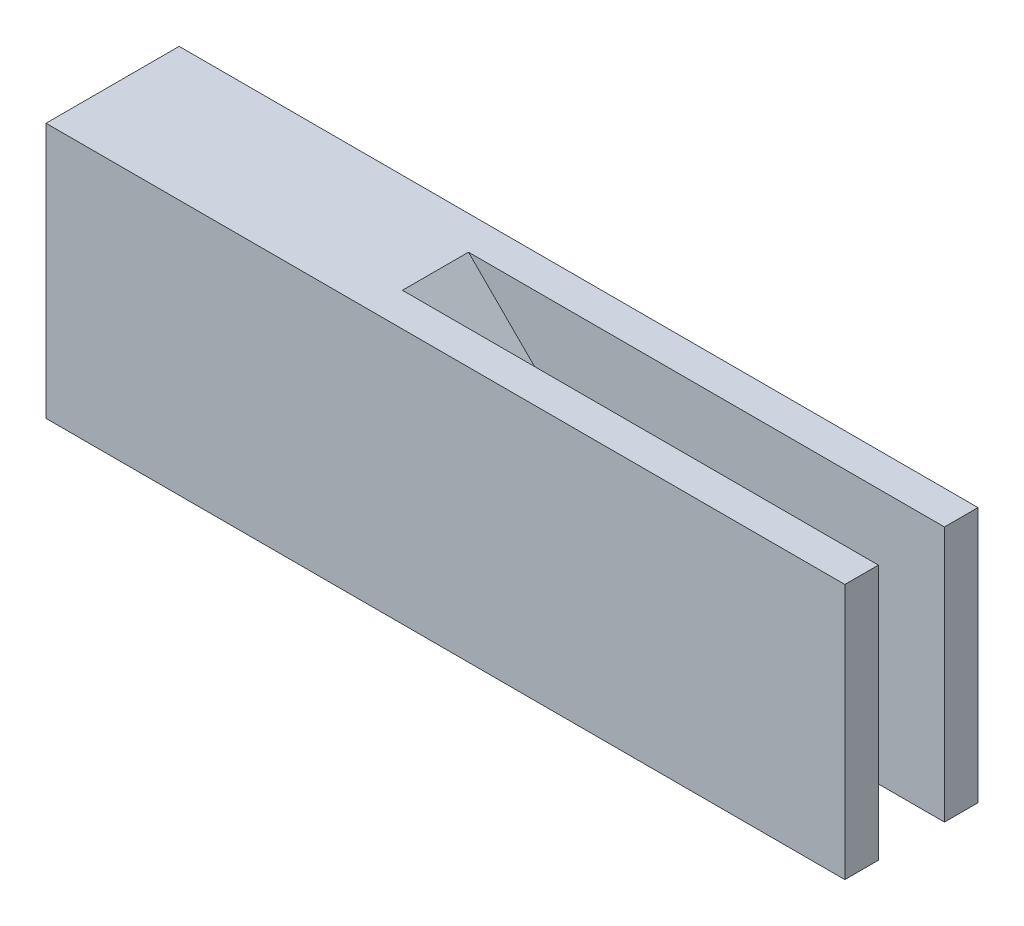
ISO-10303-21;
HEADER;
FILE_DESCRIPTION(('STEP AP214'),'2;1');
FILE_NAME('part.step','',(''),(''),'','','');
FILE_SCHEMA(('AUTOMOTIVE_DESIGN { 1 0 10303 214 1 1 1 1 }'));
ENDSEC;
DATA;
#1=APPLICATION_CONTEXT('core data for automotive mechanical design processes');
#2=APPLICATION_PROTOCOL_DEFINITION('international standard','automotive_design',2000,#1);
#3=PRODUCT_CONTEXT('',#1,'mechanical');
#4=PRODUCT('Part','Part','',(#3));
#5=PRODUCT_RELATED_PRODUCT_CATEGORY('part','',(#4));
#6=PRODUCT_DEFINITION_FORMATION('','',#4);
#7=PRODUCT_DEFINITION_CONTEXT('part definition',#1,'design');
#8=PRODUCT_DEFINITION('design','',#6,#7);
#9=PRODUCT_DEFINITION_SHAPE('','',#8);
#10=(LENGTH_UNIT() NAMED_UNIT(*) SI_UNIT(.MILLI.,.METRE.));
#11=(NAMED_UNIT(*) PLANE_ANGLE_UNIT() SI_UNIT($,.RADIAN.));
#12=(NAMED_UNIT(*) SI_UNIT($,.STERADIAN.) SOLID_ANGLE_UNIT());
#13=UNCERTAINTY_MEASURE_WITH_UNIT(LENGTH_MEASURE(1.E-05),#10,'distance_accuracy_value','');
#14=(GEOMETRIC_REPRESENTATION_CONTEXT(3) GLOBAL_UNCERTAINTY_ASSIGNED_CONTEXT((#13)) GLOBAL_UNIT_ASSIGNED_CONTEXT((#10,
#11,#12)) REPRESENTATION_CONTEXT('',''));
#15=CARTESIAN_POINT('',(0.,0.,0.));
#16=DIRECTION('',(0.,0.,1.));
#17=DIRECTION('',(1.,0.,0.));
#18=AXIS2_PLACEMENT_3D('',#15,#16,#17);
#19=CARTESIAN_POINT('',(25.4,0.,0.));
#20=DIRECTION('',(-1.,0.,0.));
#21=DIRECTION('',(0.,0.,1.));
#22=AXIS2_PLACEMENT_3D('',#19,#20,#21);
#23=PLANE('',#22);
#24=DIRECTION('',(0.,-1.,0.));
#25=VECTOR('',#24,1.);
#26=CARTESIAN_POINT('',(25.4,12.192,-4.7498));
#27=LINE('',#26,#25);
#28=CARTESIAN_POINT('',(25.4,2.19199999999999,-4.7498));
#29=VERTEX_POINT('',#28);
#30=CARTESIAN_POINT('',(25.4,0.,-4.7498));
#31=VERTEX_POINT('',#30);
#32=EDGE_CURVE('E139',#29,#31,#27,.T.);
#33=ORIENTED_EDGE('',*,*,#32,.F.);
#34=DIRECTION('',(0.,0.,1.));
#35=VECTOR('',#34,1.);
#36=CARTESIAN_POINT('',(25.4,2.19199999999999,0.));
#37=LINE('',#36,#35);
#38=CARTESIAN_POINT('',(25.4,2.19199999999999,-1.6002));
#39=VERTEX_POINT('',#38);
#40=EDGE_CURVE('E203',#29,#39,#37,.T.);
#41=ORIENTED_EDGE('',*,*,#40,.T.);
#42=DIRECTION('',(0.,1.,0.));
#43=VECTOR('',#42,1.);
#44=CARTESIAN_POINT('',(25.4,12.192,-1.6002));
#45=LINE('',#44,#43);
#46=CARTESIAN_POINT('',(25.4,0.,-1.6002));
#47=VERTEX_POINT('',#46);
#48=EDGE_CURVE('E154',#47,#39,#45,.T.);
#49=ORIENTED_EDGE('',*,*,#48,.F.);
#50=DIRECTION('',(0.,0.,-1.));
#51=VECTOR('',#50,1.);
#52=CARTESIAN_POINT('',(25.4,0.,0.));
#53=LINE('',#52,#51);
#54=EDGE_CURVE('E179',#47,#31,#53,.T.);
#55=ORIENTED_EDGE('',*,*,#54,.T.);
#56=EDGE_LOOP('',(#33,#41,#49,#55));
#57=FACE_BOUND('',#56,.T.);
#58=ADVANCED_FACE('F41',(#57),#23,.F.);
#59=CARTESIAN_POINT('',(25.4,0.,0.));
#60=DIRECTION('',(0.,0.,-1.));
#61=DIRECTION('',(0.,1.,0.));
#62=AXIS2_PLACEMENT_3D('',#59,#60,#61);
#63=PLANE('',#62);
#64=DIRECTION('',(0.,-1.,0.));
#65=VECTOR('',#64,1.);
#66=CARTESIAN_POINT('',(0.,0.,0.));
#67=LINE('',#66,#65);
#68=CARTESIAN_POINT('',(0.,12.192,0.));
#69=VERTEX_POINT('',#68);
#70=CARTESIAN_POINT('',(0.,0.,0.));
#71=VERTEX_POINT('',#70);
#72=EDGE_CURVE('E178',#69,#71,#67,.T.);
#73=ORIENTED_EDGE('',*,*,#72,.T.);
#74=DIRECTION('',(-1.,0.,0.));
#75=VECTOR('',#74,1.);
#76=CARTESIAN_POINT('',(25.4,0.,0.));
#77=LINE('',#76,#75);
#78=CARTESIAN_POINT('',(38.1,0.,0.));
#79=VERTEX_POINT('',#78);
#80=EDGE_CURVE('E199',#79,#71,#77,.T.);
#81=ORIENTED_EDGE('',*,*,#80,.F.);
#82=DIRECTION('',(0.,-1.,0.));
#83=VECTOR('',#82,1.);
#84=CARTESIAN_POINT('',(38.1,12.192,0.));
#85=LINE('',#84,#83);
#86=CARTESIAN_POINT('',(38.1,12.192,0.));
#87=VERTEX_POINT('',#86);
#88=EDGE_CURVE('E155',#87,#79,#85,.T.);
#89=ORIENTED_EDGE('',*,*,#88,.F.);
#90=DIRECTION('',(-1.,0.,0.));
#91=VECTOR('',#90,1.);
#92=CARTESIAN_POINT('',(25.4,12.192,0.));
#93=LINE('',#92,#91);
#94=EDGE_CURVE('E126',#87,#69,#93,.T.);
#95=ORIENTED_EDGE('',*,*,#94,.T.);
#96=EDGE_LOOP('',(#73,#81,#89,#95));
#97=FACE_BOUND('',#96,.T.);
#98=ADVANCED_FACE('F230',(#97),#63,.F.);
#99=CARTESIAN_POINT('',(25.4,0.,0.));
#100=DIRECTION('',(0.,1.,0.));
#101=DIRECTION('',(0.,0.,1.));
#102=AXIS2_PLACEMENT_3D('',#99,#100,#101);
#103=PLANE('',#102);
#104=DIRECTION('',(0.,0.,-1.));
#105=VECTOR('',#104,1.);
#106=CARTESIAN_POINT('',(0.,0.,0.));
#107=LINE('',#106,#105);
#108=CARTESIAN_POINT('',(0.,0.,-6.35));
#109=VERTEX_POINT('',#108);
#110=EDGE_CURVE('E187',#71,#109,#107,.T.);
#111=ORIENTED_EDGE('',*,*,#110,.T.);
#112=DIRECTION('',(-1.,0.,0.));
#113=VECTOR('',#112,1.);
#114=CARTESIAN_POINT('',(25.4,0.,-6.35));
#115=LINE('',#114,#113);
#116=CARTESIAN_POINT('',(38.1,0.,-6.35));
#117=VERTEX_POINT('',#116);
#118=EDGE_CURVE('E125',#117,#109,#115,.T.);
#119=ORIENTED_EDGE('',*,*,#118,.F.);
#120=DIRECTION('',(0.,0.,-1.));
#121=VECTOR('',#120,1.);
#122=CARTESIAN_POINT('',(38.1,0.,-6.35));
#123=LINE('',#122,#121);
#124=CARTESIAN_POINT('',(38.1,0.,-4.7498));
#125=VERTEX_POINT('',#124);
#126=EDGE_CURVE('E137',#125,#117,#123,.T.);
#127=ORIENTED_EDGE('',*,*,#126,.F.);
#128=DIRECTION('',(-1.,0.,0.));
#129=VECTOR('',#128,1.);
#130=CARTESIAN_POINT('',(38.1,0.,-4.7498));
#131=LINE('',#130,#129);
#132=EDGE_CURVE('E147',#125,#31,#131,.T.);
#133=ORIENTED_EDGE('',*,*,#132,.T.);
#134=ORIENTED_EDGE('',*,*,#54,.F.);
#135=DIRECTION('',(-1.,0.,0.));
#136=VECTOR('',#135,1.);
#137=CARTESIAN_POINT('',(38.1,0.,-1.6002));
#138=LINE('',#137,#136);
#139=CARTESIAN_POINT('',(38.1,0.,-1.6002));
#140=VERTEX_POINT('',#139);
#141=EDGE_CURVE('E174',#140,#47,#138,.T.);
#142=ORIENTED_EDGE('',*,*,#141,.F.);
#143=DIRECTION('',(0.,0.,-1.));
#144=VECTOR('',#143,1.);
#145=CARTESIAN_POINT('',(38.1,0.,0.));
#146=LINE('',#145,#144);
#147=EDGE_CURVE('E159',#79,#140,#146,.T.);
#148=ORIENTED_EDGE('',*,*,#147,.F.);
#149=ORIENTED_EDGE('',*,*,#80,.T.);
#150=EDGE_LOOP('',(#111,#119,#127,#133,#134,#142,#148,#149));
#151=FACE_BOUND('',#150,.T.);
#152=ADVANCED_FACE('F224',(#151),#103,.F.);
#153=CARTESIAN_POINT('',(25.4,0.,-6.35));
#154=DIRECTION('',(0.,0.,1.));
#155=DIRECTION('',(0.,-1.,0.));
#156=AXIS2_PLACEMENT_3D('',#153,#154,#155);
#157=PLANE('',#156);
#158=DIRECTION('',(0.,1.,0.));
#159=VECTOR('',#158,1.);
#160=CARTESIAN_POINT('',(0.,0.,-6.35));
#161=LINE('',#160,#159);
#162=CARTESIAN_POINT('',(0.,12.192,-6.35));
#163=VERTEX_POINT('',#162);
#164=EDGE_CURVE('E122',#109,#163,#161,.T.);
#165=ORIENTED_EDGE('',*,*,#164,.T.);
#166=DIRECTION('',(-1.,0.,0.));
#167=VECTOR('',#166,1.);
#168=CARTESIAN_POINT('',(25.4,12.192,-6.35));
#169=LINE('',#168,#167);
#170=CARTESIAN_POINT('',(38.1,12.192,-6.35));
#171=VERTEX_POINT('',#170);
#172=EDGE_CURVE('E115',#171,#163,#169,.T.);
#173=ORIENTED_EDGE('',*,*,#172,.F.);
#174=DIRECTION('',(0.,1.,0.));
#175=VECTOR('',#174,1.);
#176=CARTESIAN_POINT('',(38.1,12.192,-6.35));
#177=LINE('',#176,#175);
#178=EDGE_CURVE('E120',#117,#171,#177,.T.);
#179=ORIENTED_EDGE('',*,*,#178,.F.);
#180=ORIENTED_EDGE('',*,*,#118,.T.);
#181=EDGE_LOOP('',(#165,#173,#179,#180));
#182=FACE_BOUND('',#181,.T.);
#183=ADVANCED_FACE('F117',(#182),#157,.F.);
#184=CARTESIAN_POINT('',(25.4,12.192,0.));
#185=DIRECTION('',(0.,-1.,0.));
#186=DIRECTION('',(0.,0.,-1.));
#187=AXIS2_PLACEMENT_3D('',#184,#185,#186);
#188=PLANE('',#187);
#189=DIRECTION('',(-1.,0.,0.));
#190=VECTOR('',#189,1.);
#191=CARTESIAN_POINT('',(38.1,12.192,-1.6002));
#192=LINE('',#191,#190);
#193=CARTESIAN_POINT('',(38.1,12.192,-1.6002));
#194=VERTEX_POINT('',#193);
#195=CARTESIAN_POINT('',(15.4,12.192,-1.6002));
#196=VERTEX_POINT('',#195);
#197=EDGE_CURVE('E58',#194,#196,#192,.T.);
#198=ORIENTED_EDGE('',*,*,#197,.T.);
#199=DIRECTION('',(0.,0.,-1.));
#200=VECTOR('',#199,1.);
#201=CARTESIAN_POINT('',(15.4,12.192,0.));
#202=LINE('',#201,#200);
#203=CARTESIAN_POINT('',(15.4,12.192,-4.7498));
#204=VERTEX_POINT('',#203);
#205=EDGE_CURVE('E207',#196,#204,#202,.T.);
#206=ORIENTED_EDGE('',*,*,#205,.T.);
#207=DIRECTION('',(-1.,0.,0.));
#208=VECTOR('',#207,1.);
#209=CARTESIAN_POINT('',(38.1,12.192,-4.7498));
#210=LINE('',#209,#208);
#211=CARTESIAN_POINT('',(38.1,12.192,-4.7498));
#212=VERTEX_POINT('',#211);
#213=EDGE_CURVE('E65',#212,#204,#210,.T.);
#214=ORIENTED_EDGE('',*,*,#213,.F.);
#215=DIRECTION('',(0.,0.,1.));
#216=VECTOR('',#215,1.);
#217=CARTESIAN_POINT('',(38.1,12.192,-6.35));
#218=LINE('',#217,#216);
#219=EDGE_CURVE('E128',#171,#212,#218,.T.);
#220=ORIENTED_EDGE('',*,*,#219,.F.);
#221=ORIENTED_EDGE('',*,*,#172,.T.);
#222=DIRECTION('',(0.,0.,1.));
#223=VECTOR('',#222,1.);
#224=CARTESIAN_POINT('',(0.,12.192,0.));
#225=LINE('',#224,#223);
#226=EDGE_CURVE('E183',#163,#69,#225,.T.);
#227=ORIENTED_EDGE('',*,*,#226,.T.);
#228=ORIENTED_EDGE('',*,*,#94,.F.);
#229=DIRECTION('',(0.,0.,1.));
#230=VECTOR('',#229,1.);
#231=CARTESIAN_POINT('',(38.1,12.192,0.));
#232=LINE('',#231,#230);
#233=EDGE_CURVE('E165',#194,#87,#232,.T.);
#234=ORIENTED_EDGE('',*,*,#233,.F.);
#235=EDGE_LOOP('',(#198,#206,#214,#220,#221,#227,#228,#234));
#236=FACE_BOUND('',#235,.T.);
#237=ADVANCED_FACE('F129',(#236),#188,.F.);
#238=CARTESIAN_POINT('',(0.,0.,0.));
#239=DIRECTION('',(-1.,0.,0.));
#240=DIRECTION('',(0.,0.,1.));
#241=AXIS2_PLACEMENT_3D('',#238,#239,#240);
#242=PLANE('',#241);
#243=ORIENTED_EDGE('',*,*,#72,.F.);
#244=ORIENTED_EDGE('',*,*,#226,.F.);
#245=ORIENTED_EDGE('',*,*,#164,.F.);
#246=ORIENTED_EDGE('',*,*,#110,.F.);
#247=EDGE_LOOP('',(#243,#244,#245,#246));
#248=FACE_BOUND('',#247,.T.);
#249=ADVANCED_FACE('F227',(#248),#242,.T.);
#250=CARTESIAN_POINT('',(38.1,12.192,-1.6002));
#251=DIRECTION('',(0.,0.,1.));
#252=DIRECTION('',(0.,-1.,0.));
#253=AXIS2_PLACEMENT_3D('',#250,#251,#252);
#254=PLANE('',#253);
#255=ORIENTED_EDGE('',*,*,#48,.T.);
#256=DIRECTION('',(0.707106781186549,-0.707106781186546,0.));
#257=VECTOR('',#256,1.);
#258=CARTESIAN_POINT('',(26.75,0.841999999999982,-1.6002));
#259=LINE('',#258,#257);
#260=EDGE_CURVE('E51',#39,#196,#259,.F.);
#261=ORIENTED_EDGE('',*,*,#260,.T.);
#262=ORIENTED_EDGE('',*,*,#197,.F.);
#263=DIRECTION('',(0.,1.,0.));
#264=VECTOR('',#263,1.);
#265=CARTESIAN_POINT('',(38.1,12.192,-1.6002));
#266=LINE('',#265,#264);
#267=EDGE_CURVE('E162',#140,#194,#266,.T.);
#268=ORIENTED_EDGE('',*,*,#267,.F.);
#269=ORIENTED_EDGE('',*,*,#141,.T.);
#270=EDGE_LOOP('',(#255,#261,#262,#268,#269));
#271=FACE_BOUND('',#270,.T.);
#272=ADVANCED_FACE('F212',(#271),#254,.F.);
#273=CARTESIAN_POINT('',(38.1,0.,0.));
#274=DIRECTION('',(1.,0.,0.));
#275=DIRECTION('',(0.,0.,-1.));
#276=AXIS2_PLACEMENT_3D('',#273,#274,#275);
#277=PLANE('',#276);
#278=ORIENTED_EDGE('',*,*,#88,.T.);
#279=ORIENTED_EDGE('',*,*,#147,.T.);
#280=ORIENTED_EDGE('',*,*,#267,.T.);
#281=ORIENTED_EDGE('',*,*,#233,.T.);
#282=EDGE_LOOP('',(#278,#279,#280,#281));
#283=FACE_BOUND('',#282,.T.);
#284=ADVANCED_FACE('F233',(#283),#277,.T.);
#285=CARTESIAN_POINT('',(38.1,12.192,-4.7498));
#286=DIRECTION('',(0.,0.,-1.));
#287=DIRECTION('',(0.,1.,0.));
#288=AXIS2_PLACEMENT_3D('',#285,#286,#287);
#289=PLANE('',#288);
#290=ORIENTED_EDGE('',*,*,#213,.T.);
#291=DIRECTION('',(-0.707106781186549,0.707106781186546,0.));
#292=VECTOR('',#291,1.);
#293=CARTESIAN_POINT('',(26.75,0.841999999999982,-4.7498));
#294=LINE('',#293,#292);
#295=EDGE_CURVE('E11',#204,#29,#294,.F.);
#296=ORIENTED_EDGE('',*,*,#295,.T.);
#297=ORIENTED_EDGE('',*,*,#32,.T.);
#298=ORIENTED_EDGE('',*,*,#132,.F.);
#299=DIRECTION('',(0.,-1.,0.));
#300=VECTOR('',#299,1.);
#301=CARTESIAN_POINT('',(38.1,12.192,-4.7498));
#302=LINE('',#301,#300);
#303=EDGE_CURVE('E132',#212,#125,#302,.T.);
#304=ORIENTED_EDGE('',*,*,#303,.F.);
#305=EDGE_LOOP('',(#290,#296,#297,#298,#304));
#306=FACE_BOUND('',#305,.T.);
#307=ADVANCED_FACE('F218',(#306),#289,.F.);
#308=CARTESIAN_POINT('',(38.1,0.,0.));
#309=DIRECTION('',(-1.,0.,0.));
#310=DIRECTION('',(0.,0.,1.));
#311=AXIS2_PLACEMENT_3D('',#308,#309,#310);
#312=PLANE('',#311);
#313=ORIENTED_EDGE('',*,*,#178,.T.);
#314=ORIENTED_EDGE('',*,*,#219,.T.);
#315=ORIENTED_EDGE('',*,*,#303,.T.);
#316=ORIENTED_EDGE('',*,*,#126,.T.);
#317=EDGE_LOOP('',(#313,#314,#315,#316));
#318=FACE_BOUND('',#317,.T.);
#319=ADVANCED_FACE('F135',(#318),#312,.F.);
#320=CARTESIAN_POINT('',(25.4,2.19199999999999,0.));
#321=DIRECTION('',(-0.707106781186546,-0.707106781186549,0.));
#322=DIRECTION('',(0.,0.,1.));
#323=AXIS2_PLACEMENT_3D('',#320,#321,#322);
#324=PLANE('',#323);
#325=ORIENTED_EDGE('',*,*,#295,.F.);
#326=ORIENTED_EDGE('',*,*,#205,.F.);
#327=ORIENTED_EDGE('',*,*,#260,.F.);
#328=ORIENTED_EDGE('',*,*,#40,.F.);
#329=EDGE_LOOP('',(#325,#326,#327,#328));
#330=FACE_BOUND('',#329,.T.);
#331=ADVANCED_FACE('F44',(#330),#324,.F.);
#332=CLOSED_SHELL('',(#58,#98,#152,#183,#237,#249,#272,#284,#307,#319,#331));
#333=MANIFOLD_SOLID_BREP('B2',#332);
#334=ADVANCED_BREP_SHAPE_REPRESENTATION('',(#18,#333),#14);
#335=SHAPE_DEFINITION_REPRESENTATION(#9,#334);
ENDSEC;
END-ISO-10303-21;
